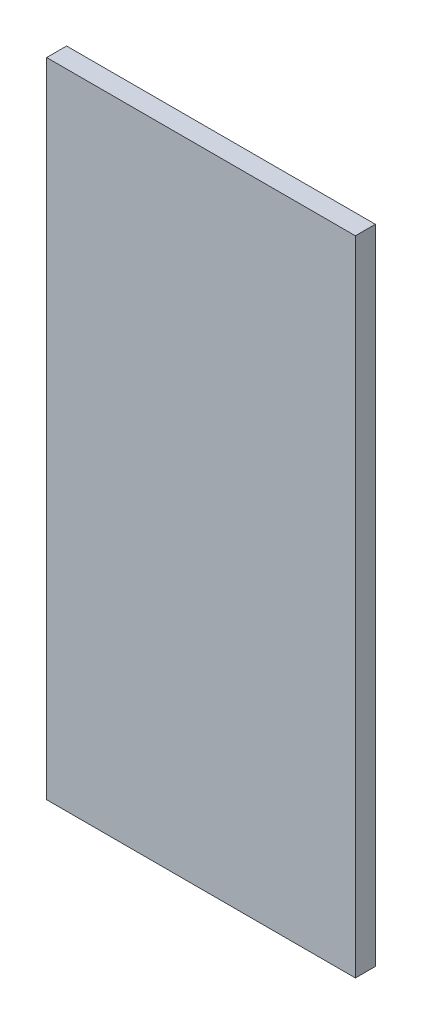
ISO-10303-21;
HEADER;
FILE_DESCRIPTION(('STEP AP214'),'2;1');
FILE_NAME('part.step','',(''),(''),'','','');
FILE_SCHEMA(('AUTOMOTIVE_DESIGN { 1 0 10303 214 1 1 1 1 }'));
ENDSEC;
DATA;
#1=APPLICATION_CONTEXT('core data for automotive mechanical design processes');
#2=APPLICATION_PROTOCOL_DEFINITION('international standard','automotive_design',2000,#1);
#3=PRODUCT_CONTEXT('',#1,'mechanical');
#4=PRODUCT('Part','Part','',(#3));
#5=PRODUCT_RELATED_PRODUCT_CATEGORY('part','',(#4));
#6=PRODUCT_DEFINITION_FORMATION('','',#4);
#7=PRODUCT_DEFINITION_CONTEXT('part definition',#1,'design');
#8=PRODUCT_DEFINITION('design','',#6,#7);
#9=PRODUCT_DEFINITION_SHAPE('','',#8);
#10=(LENGTH_UNIT() NAMED_UNIT(*) SI_UNIT(.MILLI.,.METRE.));
#11=(NAMED_UNIT(*) PLANE_ANGLE_UNIT() SI_UNIT($,.RADIAN.));
#12=(NAMED_UNIT(*) SI_UNIT($,.STERADIAN.) SOLID_ANGLE_UNIT());
#13=UNCERTAINTY_MEASURE_WITH_UNIT(LENGTH_MEASURE(1.E-05),#10,'distance_accuracy_value','');
#14=(GEOMETRIC_REPRESENTATION_CONTEXT(3) GLOBAL_UNCERTAINTY_ASSIGNED_CONTEXT((#13)) GLOBAL_UNIT_ASSIGNED_CONTEXT((#10,
#11,#12)) REPRESENTATION_CONTEXT('',''));
#15=CARTESIAN_POINT('',(0.,0.,0.));
#16=DIRECTION('',(0.,0.,1.));
#17=DIRECTION('',(1.,0.,0.));
#18=AXIS2_PLACEMENT_3D('',#15,#16,#17);
#19=CARTESIAN_POINT('',(87.8420028686523,100.66300201416,0.));
#20=DIRECTION('',(1.,0.,0.));
#21=DIRECTION('',(0.,-1.,0.));
#22=AXIS2_PLACEMENT_3D('',#19,#20,#21);
#23=PLANE('',#22);
#24=DIRECTION('',(0.,-1.,0.));
#25=VECTOR('',#24,1.);
#26=CARTESIAN_POINT('',(87.8420028686523,100.66300201416,0.03556));
#27=LINE('',#26,#25);
#28=CARTESIAN_POINT('',(87.8420028686523,100.66300201416,0.03556));
#29=VERTEX_POINT('',#28);
#30=CARTESIAN_POINT('',(87.8420028686523,99.5179977416992,0.03556));
#31=VERTEX_POINT('',#30);
#32=EDGE_CURVE('E11',#29,#31,#27,.T.);
#33=ORIENTED_EDGE('',*,*,#32,.F.);
#34=DIRECTION('',(0.,0.,1.));
#35=VECTOR('',#34,1.);
#36=CARTESIAN_POINT('',(87.8420028686523,100.66300201416,0.));
#37=LINE('',#36,#35);
#38=CARTESIAN_POINT('',(87.8420028686523,100.66300201416,0.));
#39=VERTEX_POINT('',#38);
#40=EDGE_CURVE('E24',#39,#29,#37,.T.);
#41=ORIENTED_EDGE('',*,*,#40,.F.);
#42=DIRECTION('',(0.,-1.,0.));
#43=VECTOR('',#42,1.);
#44=CARTESIAN_POINT('',(87.8420028686523,100.66300201416,0.));
#45=LINE('',#44,#43);
#46=CARTESIAN_POINT('',(87.8420028686523,99.5179977416992,0.));
#47=VERTEX_POINT('',#46);
#48=EDGE_CURVE('E75',#39,#47,#45,.T.);
#49=ORIENTED_EDGE('',*,*,#48,.T.);
#50=DIRECTION('',(0.,0.,1.));
#51=VECTOR('',#50,1.);
#52=CARTESIAN_POINT('',(87.8420028686523,99.5179977416992,0.));
#53=LINE('',#52,#51);
#54=EDGE_CURVE('E37',#47,#31,#53,.T.);
#55=ORIENTED_EDGE('',*,*,#54,.T.);
#56=EDGE_LOOP('',(#33,#41,#49,#55));
#57=FACE_BOUND('',#56,.T.);
#58=ADVANCED_FACE('F17',(#57),#23,.F.);
#59=CARTESIAN_POINT('',(87.8420028686523,99.5179977416992,0.));
#60=DIRECTION('',(0.,1.,0.));
#61=DIRECTION('',(1.,0.,0.));
#62=AXIS2_PLACEMENT_3D('',#59,#60,#61);
#63=PLANE('',#62);
#64=DIRECTION('',(1.,0.,0.));
#65=VECTOR('',#64,1.);
#66=CARTESIAN_POINT('',(87.8420028686523,99.5179977416992,0.03556));
#67=LINE('',#66,#65);
#68=CARTESIAN_POINT('',(88.3919982910156,99.5179977416992,0.03556));
#69=VERTEX_POINT('',#68);
#70=EDGE_CURVE('E83',#31,#69,#67,.T.);
#71=ORIENTED_EDGE('',*,*,#70,.F.);
#72=ORIENTED_EDGE('',*,*,#54,.F.);
#73=DIRECTION('',(1.,0.,0.));
#74=VECTOR('',#73,1.);
#75=CARTESIAN_POINT('',(87.8420028686523,99.5179977416992,0.));
#76=LINE('',#75,#74);
#77=CARTESIAN_POINT('',(88.3919982910156,99.5179977416992,0.));
#78=VERTEX_POINT('',#77);
#79=EDGE_CURVE('E81',#47,#78,#76,.T.);
#80=ORIENTED_EDGE('',*,*,#79,.T.);
#81=DIRECTION('',(0.,0.,1.));
#82=VECTOR('',#81,1.);
#83=CARTESIAN_POINT('',(88.3919982910156,99.5179977416992,0.));
#84=LINE('',#83,#82);
#85=EDGE_CURVE('E67',#78,#69,#84,.T.);
#86=ORIENTED_EDGE('',*,*,#85,.T.);
#87=EDGE_LOOP('',(#71,#72,#80,#86));
#88=FACE_BOUND('',#87,.T.);
#89=ADVANCED_FACE('F89',(#88),#63,.F.);
#90=CARTESIAN_POINT('',(88.3919982910156,99.5179977416992,0.));
#91=DIRECTION('',(-1.,0.,0.));
#92=DIRECTION('',(0.,1.,0.));
#93=AXIS2_PLACEMENT_3D('',#90,#91,#92);
#94=PLANE('',#93);
#95=DIRECTION('',(0.,1.,0.));
#96=VECTOR('',#95,1.);
#97=CARTESIAN_POINT('',(88.3919982910156,99.5179977416992,0.03556));
#98=LINE('',#97,#96);
#99=CARTESIAN_POINT('',(88.3919982910156,100.66300201416,0.03556));
#100=VERTEX_POINT('',#99);
#101=EDGE_CURVE('E71',#69,#100,#98,.T.);
#102=ORIENTED_EDGE('',*,*,#101,.F.);
#103=ORIENTED_EDGE('',*,*,#85,.F.);
#104=DIRECTION('',(0.,1.,0.));
#105=VECTOR('',#104,1.);
#106=CARTESIAN_POINT('',(88.3919982910156,99.5179977416992,0.));
#107=LINE('',#106,#105);
#108=CARTESIAN_POINT('',(88.3919982910156,100.66300201416,0.));
#109=VERTEX_POINT('',#108);
#110=EDGE_CURVE('E63',#78,#109,#107,.T.);
#111=ORIENTED_EDGE('',*,*,#110,.T.);
#112=DIRECTION('',(0.,0.,1.));
#113=VECTOR('',#112,1.);
#114=CARTESIAN_POINT('',(88.3919982910156,100.66300201416,0.));
#115=LINE('',#114,#113);
#116=EDGE_CURVE('E53',#109,#100,#115,.T.);
#117=ORIENTED_EDGE('',*,*,#116,.T.);
#118=EDGE_LOOP('',(#102,#103,#111,#117));
#119=FACE_BOUND('',#118,.T.);
#120=ADVANCED_FACE('F66',(#119),#94,.F.);
#121=CARTESIAN_POINT('',(88.3919982910156,100.66300201416,0.));
#122=DIRECTION('',(0.,-1.,0.));
#123=DIRECTION('',(-1.,0.,0.));
#124=AXIS2_PLACEMENT_3D('',#121,#122,#123);
#125=PLANE('',#124);
#126=DIRECTION('',(-1.,0.,0.));
#127=VECTOR('',#126,1.);
#128=CARTESIAN_POINT('',(88.3919982910156,100.66300201416,0.03556));
#129=LINE('',#128,#127);
#130=EDGE_CURVE('E59',#100,#29,#129,.T.);
#131=ORIENTED_EDGE('',*,*,#130,.F.);
#132=ORIENTED_EDGE('',*,*,#116,.F.);
#133=DIRECTION('',(-1.,0.,0.));
#134=VECTOR('',#133,1.);
#135=CARTESIAN_POINT('',(88.3919982910156,100.66300201416,0.));
#136=LINE('',#135,#134);
#137=EDGE_CURVE('E57',#109,#39,#136,.T.);
#138=ORIENTED_EDGE('',*,*,#137,.T.);
#139=ORIENTED_EDGE('',*,*,#40,.T.);
#140=EDGE_LOOP('',(#131,#132,#138,#139));
#141=FACE_BOUND('',#140,.T.);
#142=ADVANCED_FACE('F55',(#141),#125,.F.);
#143=CARTESIAN_POINT('',(87.8420028686523,100.66300201416,0.));
#144=DIRECTION('',(0.,0.,-1.));
#145=DIRECTION('',(-1.,0.,0.));
#146=AXIS2_PLACEMENT_3D('',#143,#144,#145);
#147=PLANE('',#146);
#148=ORIENTED_EDGE('',*,*,#137,.F.);
#149=ORIENTED_EDGE('',*,*,#110,.F.);
#150=ORIENTED_EDGE('',*,*,#79,.F.);
#151=ORIENTED_EDGE('',*,*,#48,.F.);
#152=EDGE_LOOP('',(#148,#149,#150,#151));
#153=FACE_BOUND('',#152,.T.);
#154=ADVANCED_FACE('F74',(#153),#147,.T.);
#155=CARTESIAN_POINT('',(87.8420028686523,100.66300201416,0.03556));
#156=DIRECTION('',(0.,0.,-1.));
#157=DIRECTION('',(-1.,0.,0.));
#158=AXIS2_PLACEMENT_3D('',#155,#156,#157);
#159=PLANE('',#158);
#160=ORIENTED_EDGE('',*,*,#32,.T.);
#161=ORIENTED_EDGE('',*,*,#70,.T.);
#162=ORIENTED_EDGE('',*,*,#101,.T.);
#163=ORIENTED_EDGE('',*,*,#130,.T.);
#164=EDGE_LOOP('',(#160,#161,#162,#163));
#165=FACE_BOUND('',#164,.T.);
#166=ADVANCED_FACE('F91',(#165),#159,.F.);
#167=CLOSED_SHELL('',(#58,#89,#120,#142,#154,#166));
#168=MANIFOLD_SOLID_BREP('B1',#167);
#169=ADVANCED_BREP_SHAPE_REPRESENTATION('',(#18,#168),#14);
#170=SHAPE_DEFINITION_REPRESENTATION(#9,#169);
ENDSEC;
END-ISO-10303-21;
